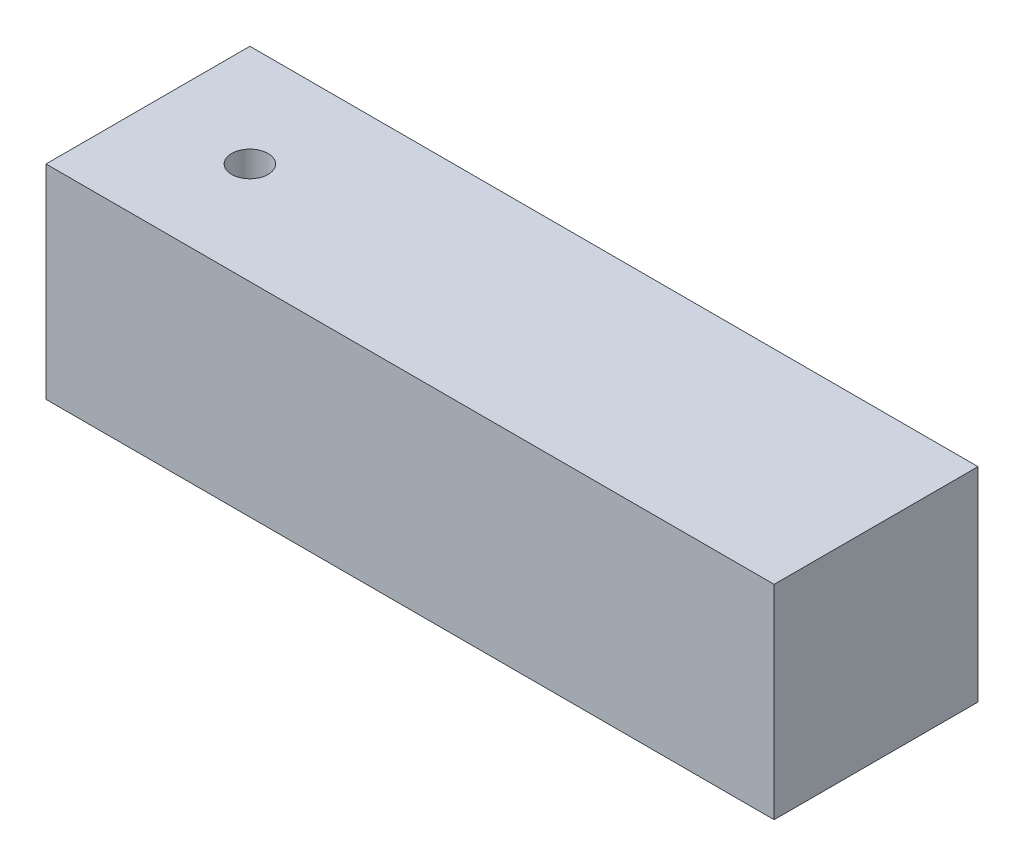
ISO-10303-21;
HEADER;
FILE_DESCRIPTION(('STEP AP214'),'2;1');
FILE_NAME('part.step','',(''),(''),'','','');
FILE_SCHEMA(('AUTOMOTIVE_DESIGN { 1 0 10303 214 1 1 1 1 }'));
ENDSEC;
DATA;
#1=APPLICATION_CONTEXT('core data for automotive mechanical design processes');
#2=APPLICATION_PROTOCOL_DEFINITION('international standard','automotive_design',2000,#1);
#3=PRODUCT_CONTEXT('',#1,'mechanical');
#4=PRODUCT('Part','Part','',(#3));
#5=PRODUCT_RELATED_PRODUCT_CATEGORY('part','',(#4));
#6=PRODUCT_DEFINITION_FORMATION('','',#4);
#7=PRODUCT_DEFINITION_CONTEXT('part definition',#1,'design');
#8=PRODUCT_DEFINITION('design','',#6,#7);
#9=PRODUCT_DEFINITION_SHAPE('','',#8);
#10=(LENGTH_UNIT() NAMED_UNIT(*) SI_UNIT(.MILLI.,.METRE.));
#11=(NAMED_UNIT(*) PLANE_ANGLE_UNIT() SI_UNIT($,.RADIAN.));
#12=(NAMED_UNIT(*) SI_UNIT($,.STERADIAN.) SOLID_ANGLE_UNIT());
#13=UNCERTAINTY_MEASURE_WITH_UNIT(LENGTH_MEASURE(1.E-05),#10,'distance_accuracy_value','');
#14=(GEOMETRIC_REPRESENTATION_CONTEXT(3) GLOBAL_UNCERTAINTY_ASSIGNED_CONTEXT((#13)) GLOBAL_UNIT_ASSIGNED_CONTEXT((#10,
#11,#12)) REPRESENTATION_CONTEXT('',''));
#15=CARTESIAN_POINT('',(0.,0.,0.));
#16=DIRECTION('',(0.,0.,1.));
#17=DIRECTION('',(1.,0.,0.));
#18=AXIS2_PLACEMENT_3D('',#15,#16,#17);
#19=CARTESIAN_POINT('',(-14.01,-0.01,14.));
#20=DIRECTION('',(0.,0.,1.));
#21=DIRECTION('',(1.,0.,0.));
#22=AXIS2_PLACEMENT_3D('',#19,#20,#21);
#23=PLANE('',#22);
#24=DIRECTION('',(1.,0.,0.));
#25=VECTOR('',#24,1.);
#26=CARTESIAN_POINT('',(36.,28.,14.));
#27=LINE('',#26,#25);
#28=CARTESIAN_POINT('',(-14.,28.,14.));
#29=VERTEX_POINT('',#28);
#30=CARTESIAN_POINT('',(86.,28.,14.));
#31=VERTEX_POINT('',#30);
#32=EDGE_CURVE('E60',#29,#31,#27,.T.);
#33=ORIENTED_EDGE('',*,*,#32,.F.);
#34=DIRECTION('',(0.,1.,0.));
#35=VECTOR('',#34,1.);
#36=CARTESIAN_POINT('',(-14.,14.,14.));
#37=LINE('',#36,#35);
#38=CARTESIAN_POINT('',(-14.,0.,14.));
#39=VERTEX_POINT('',#38);
#40=EDGE_CURVE('E57',#39,#29,#37,.T.);
#41=ORIENTED_EDGE('',*,*,#40,.F.);
#42=DIRECTION('',(-1.,0.,0.));
#43=VECTOR('',#42,1.);
#44=CARTESIAN_POINT('',(36.,0.,14.));
#45=LINE('',#44,#43);
#46=CARTESIAN_POINT('',(86.,0.,14.));
#47=VERTEX_POINT('',#46);
#48=EDGE_CURVE('E54',#47,#39,#45,.T.);
#49=ORIENTED_EDGE('',*,*,#48,.F.);
#50=DIRECTION('',(0.,-1.,0.));
#51=VECTOR('',#50,1.);
#52=CARTESIAN_POINT('',(86.,14.,14.));
#53=LINE('',#52,#51);
#54=EDGE_CURVE('E81',#31,#47,#53,.T.);
#55=ORIENTED_EDGE('',*,*,#54,.F.);
#56=EDGE_LOOP('',(#33,#41,#49,#55));
#57=FACE_BOUND('',#56,.T.);
#58=ADVANCED_FACE('F17',(#57),#23,.T.);
#59=CARTESIAN_POINT('',(86.,-0.01,14.01));
#60=DIRECTION('',(1.,0.,0.));
#61=DIRECTION('',(0.,0.,-1.));
#62=AXIS2_PLACEMENT_3D('',#59,#60,#61);
#63=PLANE('',#62);
#64=DIRECTION('',(0.,0.,-1.));
#65=VECTOR('',#64,1.);
#66=CARTESIAN_POINT('',(86.,28.,0.));
#67=LINE('',#66,#65);
#68=CARTESIAN_POINT('',(86.,28.,-14.));
#69=VERTEX_POINT('',#68);
#70=EDGE_CURVE('E86',#31,#69,#67,.T.);
#71=ORIENTED_EDGE('',*,*,#70,.F.);
#72=ORIENTED_EDGE('',*,*,#54,.T.);
#73=DIRECTION('',(0.,0.,1.));
#74=VECTOR('',#73,1.);
#75=CARTESIAN_POINT('',(86.,0.,0.));
#76=LINE('',#75,#74);
#77=CARTESIAN_POINT('',(86.,0.,-14.));
#78=VERTEX_POINT('',#77);
#79=EDGE_CURVE('E75',#78,#47,#76,.T.);
#80=ORIENTED_EDGE('',*,*,#79,.F.);
#81=DIRECTION('',(0.,-1.,0.));
#82=VECTOR('',#81,1.);
#83=CARTESIAN_POINT('',(86.,14.,-14.));
#84=LINE('',#83,#82);
#85=EDGE_CURVE('E63',#69,#78,#84,.T.);
#86=ORIENTED_EDGE('',*,*,#85,.F.);
#87=EDGE_LOOP('',(#71,#72,#80,#86));
#88=FACE_BOUND('',#87,.T.);
#89=ADVANCED_FACE('F84',(#88),#63,.T.);
#90=CARTESIAN_POINT('',(86.01,-0.01,-14.));
#91=DIRECTION('',(0.,0.,-1.));
#92=DIRECTION('',(-1.,0.,0.));
#93=AXIS2_PLACEMENT_3D('',#90,#91,#92);
#94=PLANE('',#93);
#95=DIRECTION('',(-1.,0.,0.));
#96=VECTOR('',#95,1.);
#97=CARTESIAN_POINT('',(36.,28.,-14.));
#98=LINE('',#97,#96);
#99=CARTESIAN_POINT('',(-14.,28.,-14.));
#100=VERTEX_POINT('',#99);
#101=EDGE_CURVE('E89',#69,#100,#98,.T.);
#102=ORIENTED_EDGE('',*,*,#101,.F.);
#103=ORIENTED_EDGE('',*,*,#85,.T.);
#104=DIRECTION('',(1.,0.,0.));
#105=VECTOR('',#104,1.);
#106=CARTESIAN_POINT('',(36.,0.,-14.));
#107=LINE('',#106,#105);
#108=CARTESIAN_POINT('',(-14.,0.,-14.));
#109=VERTEX_POINT('',#108);
#110=EDGE_CURVE('E70',#109,#78,#107,.T.);
#111=ORIENTED_EDGE('',*,*,#110,.F.);
#112=DIRECTION('',(0.,-1.,0.));
#113=VECTOR('',#112,1.);
#114=CARTESIAN_POINT('',(-14.,14.,-14.));
#115=LINE('',#114,#113);
#116=EDGE_CURVE('E34',#100,#109,#115,.T.);
#117=ORIENTED_EDGE('',*,*,#116,.F.);
#118=EDGE_LOOP('',(#102,#103,#111,#117));
#119=FACE_BOUND('',#118,.T.);
#120=ADVANCED_FACE('F96',(#119),#94,.T.);
#121=CARTESIAN_POINT('',(-14.,-0.01,-14.01));
#122=DIRECTION('',(-1.,0.,0.));
#123=DIRECTION('',(0.,0.,1.));
#124=AXIS2_PLACEMENT_3D('',#121,#122,#123);
#125=PLANE('',#124);
#126=DIRECTION('',(0.,0.,1.));
#127=VECTOR('',#126,1.);
#128=CARTESIAN_POINT('',(-14.,28.,0.));
#129=LINE('',#128,#127);
#130=EDGE_CURVE('E92',#100,#29,#129,.T.);
#131=ORIENTED_EDGE('',*,*,#130,.F.);
#132=ORIENTED_EDGE('',*,*,#116,.T.);
#133=DIRECTION('',(0.,0.,-1.));
#134=VECTOR('',#133,1.);
#135=CARTESIAN_POINT('',(-14.,0.,0.));
#136=LINE('',#135,#134);
#137=EDGE_CURVE('E66',#39,#109,#136,.T.);
#138=ORIENTED_EDGE('',*,*,#137,.F.);
#139=ORIENTED_EDGE('',*,*,#40,.T.);
#140=EDGE_LOOP('',(#131,#132,#138,#139));
#141=FACE_BOUND('',#140,.T.);
#142=ADVANCED_FACE('F67',(#141),#125,.T.);
#143=CARTESIAN_POINT('',(86.01,0.,14.01));
#144=DIRECTION('',(0.,-1.,0.));
#145=DIRECTION('',(-1.,0.,0.));
#146=AXIS2_PLACEMENT_3D('',#143,#144,#145);
#147=PLANE('',#146);
#148=CARTESIAN_POINT('',(0.,0.,0.));
#149=DIRECTION('',(0.,1.,0.));
#150=DIRECTION('',(0.,0.,1.));
#151=AXIS2_PLACEMENT_3D('',#148,#149,#150);
#152=CIRCLE('',#151,2.5);
#153=CARTESIAN_POINT('',(0.,0.,2.5));
#154=VERTEX_POINT('',#153);
#155=EDGE_CURVE('E21',#154,#154,#152,.F.);
#156=ORIENTED_EDGE('',*,*,#155,.F.);
#157=EDGE_LOOP('',(#156));
#158=FACE_BOUND('',#157,.T.);
#159=ORIENTED_EDGE('',*,*,#110,.T.);
#160=ORIENTED_EDGE('',*,*,#79,.T.);
#161=ORIENTED_EDGE('',*,*,#48,.T.);
#162=ORIENTED_EDGE('',*,*,#137,.T.);
#163=EDGE_LOOP('',(#159,#160,#161,#162));
#164=FACE_BOUND('',#163,.T.);
#165=ADVANCED_FACE('F73',(#158,#164),#147,.T.);
#166=CARTESIAN_POINT('',(-14.01,28.,-14.01));
#167=DIRECTION('',(0.,1.,0.));
#168=DIRECTION('',(0.,0.,1.));
#169=AXIS2_PLACEMENT_3D('',#166,#167,#168);
#170=PLANE('',#169);
#171=CARTESIAN_POINT('',(0.,28.,0.));
#172=DIRECTION('',(0.,1.,0.));
#173=DIRECTION('',(0.,0.,1.));
#174=AXIS2_PLACEMENT_3D('',#171,#172,#173);
#175=CIRCLE('',#174,2.5);
#176=CARTESIAN_POINT('',(0.,28.,2.5));
#177=VERTEX_POINT('',#176);
#178=EDGE_CURVE('E11',#177,#177,#175,.T.);
#179=ORIENTED_EDGE('',*,*,#178,.F.);
#180=EDGE_LOOP('',(#179));
#181=FACE_BOUND('',#180,.T.);
#182=ORIENTED_EDGE('',*,*,#101,.T.);
#183=ORIENTED_EDGE('',*,*,#130,.T.);
#184=ORIENTED_EDGE('',*,*,#32,.T.);
#185=ORIENTED_EDGE('',*,*,#70,.T.);
#186=EDGE_LOOP('',(#182,#183,#184,#185));
#187=FACE_BOUND('',#186,.T.);
#188=ADVANCED_FACE('F91',(#181,#187),#170,.T.);
#189=CARTESIAN_POINT('',(0.,0.,0.));
#190=DIRECTION('',(0.,1.,0.));
#191=DIRECTION('',(0.,0.,1.));
#192=AXIS2_PLACEMENT_3D('',#189,#190,#191);
#193=CYLINDRICAL_SURFACE('',#192,2.5);
#194=ORIENTED_EDGE('',*,*,#178,.T.);
#195=EDGE_LOOP('',(#194));
#196=FACE_BOUND('',#195,.T.);
#197=ORIENTED_EDGE('',*,*,#155,.T.);
#198=EDGE_LOOP('',(#197));
#199=FACE_BOUND('',#198,.T.);
#200=ADVANCED_FACE('F19',(#196,#199),#193,.F.);
#201=CLOSED_SHELL('',(#58,#89,#120,#142,#165,#188,#200));
#202=MANIFOLD_SOLID_BREP('B1',#201);
#203=ADVANCED_BREP_SHAPE_REPRESENTATION('',(#18,#202),#14);
#204=SHAPE_DEFINITION_REPRESENTATION(#9,#203);
ENDSEC;
END-ISO-10303-21;
